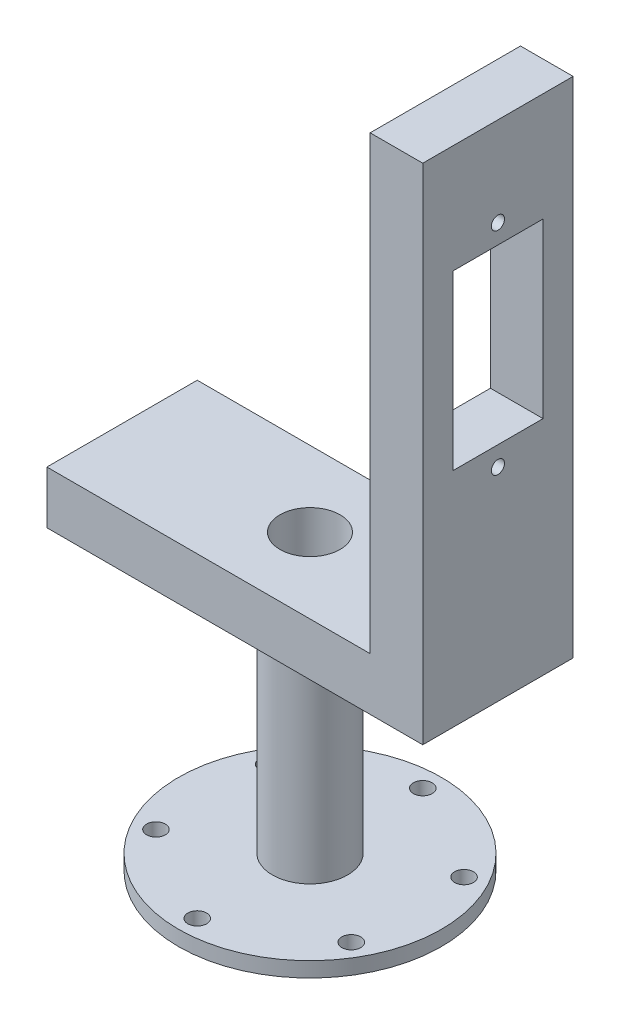
ISO-10303-21;
HEADER;
FILE_DESCRIPTION(('STEP AP214'),'2;1');
FILE_NAME('part.step','',(''),(''),'','','');
FILE_SCHEMA(('AUTOMOTIVE_DESIGN { 1 0 10303 214 1 1 1 1 }'));
ENDSEC;
DATA;
#1=APPLICATION_CONTEXT('core data for automotive mechanical design processes');
#2=APPLICATION_PROTOCOL_DEFINITION('international standard','automotive_design',2000,#1);
#3=PRODUCT_CONTEXT('',#1,'mechanical');
#4=PRODUCT('Part','Part','',(#3));
#5=PRODUCT_RELATED_PRODUCT_CATEGORY('part','',(#4));
#6=PRODUCT_DEFINITION_FORMATION('','',#4);
#7=PRODUCT_DEFINITION_CONTEXT('part definition',#1,'design');
#8=PRODUCT_DEFINITION('design','',#6,#7);
#9=PRODUCT_DEFINITION_SHAPE('','',#8);
#10=(LENGTH_UNIT() NAMED_UNIT(*) SI_UNIT(.MILLI.,.METRE.));
#11=(NAMED_UNIT(*) PLANE_ANGLE_UNIT() SI_UNIT($,.RADIAN.));
#12=(NAMED_UNIT(*) SI_UNIT($,.STERADIAN.) SOLID_ANGLE_UNIT());
#13=UNCERTAINTY_MEASURE_WITH_UNIT(LENGTH_MEASURE(1.E-05),#10,'distance_accuracy_value','');
#14=(GEOMETRIC_REPRESENTATION_CONTEXT(3) GLOBAL_UNCERTAINTY_ASSIGNED_CONTEXT((#13)) GLOBAL_UNIT_ASSIGNED_CONTEXT((#10,
#11,#12)) REPRESENTATION_CONTEXT('',''));
#15=CARTESIAN_POINT('',(0.,0.,0.));
#16=DIRECTION('',(0.,0.,1.));
#17=DIRECTION('',(1.,0.,0.));
#18=AXIS2_PLACEMENT_3D('',#15,#16,#17);
#19=CARTESIAN_POINT('',(0.,2.,0.));
#20=DIRECTION('',(0.,-1.,0.));
#21=DIRECTION('',(0.,0.,-1.));
#22=AXIS2_PLACEMENT_3D('',#19,#20,#21);
#23=CYLINDRICAL_SURFACE('',#22,17.5);
#24=CARTESIAN_POINT('',(0.,2.,0.));
#25=DIRECTION('',(0.,1.,0.));
#26=DIRECTION('',(0.,0.,1.));
#27=AXIS2_PLACEMENT_3D('',#24,#25,#26);
#28=CIRCLE('',#27,17.5);
#29=CARTESIAN_POINT('',(0.,2.,17.5));
#30=VERTEX_POINT('',#29);
#31=EDGE_CURVE('E11',#30,#30,#28,.T.);
#32=ORIENTED_EDGE('',*,*,#31,.F.);
#33=EDGE_LOOP('',(#32));
#34=FACE_BOUND('',#33,.T.);
#35=CARTESIAN_POINT('',(0.,0.,0.));
#36=DIRECTION('',(0.,1.,0.));
#37=DIRECTION('',(0.,0.,1.));
#38=AXIS2_PLACEMENT_3D('',#35,#36,#37);
#39=CIRCLE('',#38,17.5);
#40=CARTESIAN_POINT('',(0.,0.,17.5));
#41=VERTEX_POINT('',#40);
#42=EDGE_CURVE('E42',#41,#41,#39,.T.);
#43=ORIENTED_EDGE('',*,*,#42,.T.);
#44=EDGE_LOOP('',(#43));
#45=FACE_BOUND('',#44,.T.);
#46=ADVANCED_FACE('F34',(#34,#45),#23,.T.);
#47=CARTESIAN_POINT('',(0.,2.,0.));
#48=DIRECTION('',(0.,1.,0.));
#49=DIRECTION('',(0.,0.,1.));
#50=AXIS2_PLACEMENT_3D('',#47,#48,#49);
#51=PLANE('',#50);
#52=CARTESIAN_POINT('',(0.,2.,0.));
#53=DIRECTION('',(0.,1.,0.));
#54=DIRECTION('',(0.,0.,1.));
#55=AXIS2_PLACEMENT_3D('',#52,#53,#54);
#56=CIRCLE('',#55,5.);
#57=CARTESIAN_POINT('',(0.,2.,5.));
#58=VERTEX_POINT('',#57);
#59=EDGE_CURVE('E211',#58,#58,#56,.T.);
#60=ORIENTED_EDGE('',*,*,#59,.F.);
#61=EDGE_LOOP('',(#60));
#62=FACE_BOUND('',#61,.T.);
#63=CARTESIAN_POINT('',(12.9903810567665,2.,-7.50000000000015));
#64=DIRECTION('',(0.,1.,0.));
#65=DIRECTION('',(-0.866025403784433,0.,0.50000000000001));
#66=AXIS2_PLACEMENT_3D('',#63,#64,#65);
#67=CIRCLE('',#66,1.25);
#68=CARTESIAN_POINT('',(11.907849302036,2.,-6.87500000000014));
#69=VERTEX_POINT('',#68);
#70=EDGE_CURVE('E215',#69,#69,#67,.T.);
#71=ORIENTED_EDGE('',*,*,#70,.F.);
#72=EDGE_LOOP('',(#71));
#73=FACE_BOUND('',#72,.T.);
#74=CARTESIAN_POINT('',(12.9903810567666,2.,7.49999999999988));
#75=DIRECTION('',(0.,1.,0.));
#76=DIRECTION('',(-0.866025403784443,0.,-0.499999999999992));
#77=AXIS2_PLACEMENT_3D('',#74,#75,#76);
#78=CIRCLE('',#77,1.25);
#79=CARTESIAN_POINT('',(11.9078493020361,2.,6.87499999999989));
#80=VERTEX_POINT('',#79);
#81=EDGE_CURVE('E225',#80,#80,#78,.T.);
#82=ORIENTED_EDGE('',*,*,#81,.F.);
#83=EDGE_LOOP('',(#82));
#84=FACE_BOUND('',#83,.T.);
#85=CARTESIAN_POINT('',(0.,2.,15.));
#86=DIRECTION('',(0.,1.,0.));
#87=DIRECTION('',(0.,0.,-1.));
#88=AXIS2_PLACEMENT_3D('',#85,#86,#87);
#89=CIRCLE('',#88,1.25);
#90=CARTESIAN_POINT('',(0.,2.,13.75));
#91=VERTEX_POINT('',#90);
#92=EDGE_CURVE('E222',#91,#91,#89,.T.);
#93=ORIENTED_EDGE('',*,*,#92,.F.);
#94=EDGE_LOOP('',(#93));
#95=FACE_BOUND('',#94,.T.);
#96=CARTESIAN_POINT('',(-12.9903810567665,2.,7.50000000000006));
#97=DIRECTION('',(0.,1.,0.));
#98=DIRECTION('',(0.866025403784436,0.,-0.500000000000004));
#99=AXIS2_PLACEMENT_3D('',#96,#97,#98);
#100=CIRCLE('',#99,1.25);
#101=CARTESIAN_POINT('',(-11.907849302036,2.,6.87500000000006));
#102=VERTEX_POINT('',#101);
#103=EDGE_CURVE('E218',#102,#102,#100,.T.);
#104=ORIENTED_EDGE('',*,*,#103,.F.);
#105=EDGE_LOOP('',(#104));
#106=FACE_BOUND('',#105,.T.);
#107=CARTESIAN_POINT('',(-12.9903810567666,2.,-7.49999999999997));
#108=DIRECTION('',(0.,1.,0.));
#109=DIRECTION('',(0.86602540378444,0.,0.499999999999998));
#110=AXIS2_PLACEMENT_3D('',#107,#108,#109);
#111=CIRCLE('',#110,1.25);
#112=CARTESIAN_POINT('',(-11.907849302036,2.,-6.87499999999997));
#113=VERTEX_POINT('',#112);
#114=EDGE_CURVE('E221',#113,#113,#111,.T.);
#115=ORIENTED_EDGE('',*,*,#114,.F.);
#116=EDGE_LOOP('',(#115));
#117=FACE_BOUND('',#116,.T.);
#118=CARTESIAN_POINT('',(0.,2.,-15.));
#119=DIRECTION('',(0.,1.,0.));
#120=DIRECTION('',(0.,0.,1.));
#121=AXIS2_PLACEMENT_3D('',#118,#119,#120);
#122=CIRCLE('',#121,1.25);
#123=CARTESIAN_POINT('',(0.,2.,-13.75));
#124=VERTEX_POINT('',#123);
#125=EDGE_CURVE('E233',#124,#124,#122,.T.);
#126=ORIENTED_EDGE('',*,*,#125,.F.);
#127=EDGE_LOOP('',(#126));
#128=FACE_BOUND('',#127,.T.);
#129=ORIENTED_EDGE('',*,*,#31,.T.);
#130=EDGE_LOOP('',(#129));
#131=FACE_BOUND('',#130,.T.);
#132=ADVANCED_FACE('F275',(#62,#73,#84,#95,#106,#117,#128,#131),#51,.T.);
#133=CARTESIAN_POINT('',(0.,0.,0.));
#134=DIRECTION('',(0.,1.,0.));
#135=DIRECTION('',(0.,0.,1.));
#136=AXIS2_PLACEMENT_3D('',#133,#134,#135);
#137=PLANE('',#136);
#138=CARTESIAN_POINT('',(0.,0.,0.));
#139=DIRECTION('',(0.,-1.,0.));
#140=DIRECTION('',(0.,0.,-1.));
#141=AXIS2_PLACEMENT_3D('',#138,#139,#140);
#142=CIRCLE('',#141,4.);
#143=CARTESIAN_POINT('',(0.,0.,-4.));
#144=VERTEX_POINT('',#143);
#145=EDGE_CURVE('E136',#144,#144,#142,.T.);
#146=ORIENTED_EDGE('',*,*,#145,.F.);
#147=EDGE_LOOP('',(#146));
#148=FACE_BOUND('',#147,.T.);
#149=CARTESIAN_POINT('',(12.9903810567665,0.,-7.50000000000015));
#150=DIRECTION('',(0.,1.,0.));
#151=DIRECTION('',(0.,0.,1.));
#152=AXIS2_PLACEMENT_3D('',#149,#150,#151);
#153=CIRCLE('',#152,1.25);
#154=CARTESIAN_POINT('',(12.9903810567665,0.,-6.25000000000015));
#155=VERTEX_POINT('',#154);
#156=EDGE_CURVE('E37',#155,#155,#153,.T.);
#157=ORIENTED_EDGE('',*,*,#156,.T.);
#158=EDGE_LOOP('',(#157));
#159=FACE_BOUND('',#158,.T.);
#160=CARTESIAN_POINT('',(12.9903810567666,0.,7.49999999999988));
#161=DIRECTION('',(0.,1.,0.));
#162=DIRECTION('',(0.,0.,1.));
#163=AXIS2_PLACEMENT_3D('',#160,#161,#162);
#164=CIRCLE('',#163,1.25);
#165=CARTESIAN_POINT('',(12.9903810567666,0.,8.74999999999988));
#166=VERTEX_POINT('',#165);
#167=EDGE_CURVE('E248',#166,#166,#164,.T.);
#168=ORIENTED_EDGE('',*,*,#167,.T.);
#169=EDGE_LOOP('',(#168));
#170=FACE_BOUND('',#169,.T.);
#171=CARTESIAN_POINT('',(0.,0.,15.));
#172=DIRECTION('',(0.,1.,0.));
#173=DIRECTION('',(0.,0.,1.));
#174=AXIS2_PLACEMENT_3D('',#171,#172,#173);
#175=CIRCLE('',#174,1.25);
#176=CARTESIAN_POINT('',(0.,0.,16.25));
#177=VERTEX_POINT('',#176);
#178=EDGE_CURVE('E246',#177,#177,#175,.T.);
#179=ORIENTED_EDGE('',*,*,#178,.T.);
#180=EDGE_LOOP('',(#179));
#181=FACE_BOUND('',#180,.T.);
#182=CARTESIAN_POINT('',(-12.9903810567665,0.,7.50000000000006));
#183=DIRECTION('',(0.,1.,0.));
#184=DIRECTION('',(0.,0.,1.));
#185=AXIS2_PLACEMENT_3D('',#182,#183,#184);
#186=CIRCLE('',#185,1.25);
#187=CARTESIAN_POINT('',(-12.9903810567665,0.,8.75000000000006));
#188=VERTEX_POINT('',#187);
#189=EDGE_CURVE('E243',#188,#188,#186,.T.);
#190=ORIENTED_EDGE('',*,*,#189,.T.);
#191=EDGE_LOOP('',(#190));
#192=FACE_BOUND('',#191,.T.);
#193=CARTESIAN_POINT('',(-12.9903810567666,0.,-7.49999999999997));
#194=DIRECTION('',(0.,1.,0.));
#195=DIRECTION('',(0.,0.,1.));
#196=AXIS2_PLACEMENT_3D('',#193,#194,#195);
#197=CIRCLE('',#196,1.25);
#198=CARTESIAN_POINT('',(-12.9903810567666,0.,-6.24999999999997));
#199=VERTEX_POINT('',#198);
#200=EDGE_CURVE('E232',#199,#199,#197,.T.);
#201=ORIENTED_EDGE('',*,*,#200,.T.);
#202=EDGE_LOOP('',(#201));
#203=FACE_BOUND('',#202,.T.);
#204=CARTESIAN_POINT('',(0.,0.,-15.));
#205=DIRECTION('',(0.,1.,0.));
#206=DIRECTION('',(0.,0.,1.));
#207=AXIS2_PLACEMENT_3D('',#204,#205,#206);
#208=CIRCLE('',#207,1.25);
#209=CARTESIAN_POINT('',(0.,0.,-13.75));
#210=VERTEX_POINT('',#209);
#211=EDGE_CURVE('E235',#210,#210,#208,.T.);
#212=ORIENTED_EDGE('',*,*,#211,.T.);
#213=EDGE_LOOP('',(#212));
#214=FACE_BOUND('',#213,.T.);
#215=ORIENTED_EDGE('',*,*,#42,.F.);
#216=EDGE_LOOP('',(#215));
#217=FACE_BOUND('',#216,.T.);
#218=ADVANCED_FACE('F255',(#148,#159,#170,#181,#192,#203,#214,#217),#137,.F.);
#219=CARTESIAN_POINT('',(0.,-3.,-15.));
#220=DIRECTION('',(0.,1.,0.));
#221=DIRECTION('',(0.,0.,1.));
#222=AXIS2_PLACEMENT_3D('',#219,#220,#221);
#223=CYLINDRICAL_SURFACE('',#222,1.25);
#224=ORIENTED_EDGE('',*,*,#125,.T.);
#225=EDGE_LOOP('',(#224));
#226=FACE_BOUND('',#225,.T.);
#227=ORIENTED_EDGE('',*,*,#211,.F.);
#228=EDGE_LOOP('',(#227));
#229=FACE_BOUND('',#228,.T.);
#230=ADVANCED_FACE('F287',(#226,#229),#223,.F.);
#231=CARTESIAN_POINT('',(-12.9903810567666,-3.,-7.49999999999997));
#232=DIRECTION('',(0.,1.,0.));
#233=DIRECTION('',(0.,0.,1.));
#234=AXIS2_PLACEMENT_3D('',#231,#232,#233);
#235=CYLINDRICAL_SURFACE('',#234,1.25);
#236=ORIENTED_EDGE('',*,*,#114,.T.);
#237=EDGE_LOOP('',(#236));
#238=FACE_BOUND('',#237,.T.);
#239=ORIENTED_EDGE('',*,*,#200,.F.);
#240=EDGE_LOOP('',(#239));
#241=FACE_BOUND('',#240,.T.);
#242=ADVANCED_FACE('F294',(#238,#241),#235,.F.);
#243=CARTESIAN_POINT('',(-12.9903810567665,-3.,7.50000000000006));
#244=DIRECTION('',(0.,1.,0.));
#245=DIRECTION('',(0.,0.,1.));
#246=AXIS2_PLACEMENT_3D('',#243,#244,#245);
#247=CYLINDRICAL_SURFACE('',#246,1.25);
#248=ORIENTED_EDGE('',*,*,#103,.T.);
#249=EDGE_LOOP('',(#248));
#250=FACE_BOUND('',#249,.T.);
#251=ORIENTED_EDGE('',*,*,#189,.F.);
#252=EDGE_LOOP('',(#251));
#253=FACE_BOUND('',#252,.T.);
#254=ADVANCED_FACE('F299',(#250,#253),#247,.F.);
#255=CARTESIAN_POINT('',(0.,-3.,15.));
#256=DIRECTION('',(0.,1.,0.));
#257=DIRECTION('',(0.,0.,1.));
#258=AXIS2_PLACEMENT_3D('',#255,#256,#257);
#259=CYLINDRICAL_SURFACE('',#258,1.25);
#260=ORIENTED_EDGE('',*,*,#92,.T.);
#261=EDGE_LOOP('',(#260));
#262=FACE_BOUND('',#261,.T.);
#263=ORIENTED_EDGE('',*,*,#178,.F.);
#264=EDGE_LOOP('',(#263));
#265=FACE_BOUND('',#264,.T.);
#266=ADVANCED_FACE('F270',(#262,#265),#259,.F.);
#267=CARTESIAN_POINT('',(12.9903810567666,-3.,7.49999999999988));
#268=DIRECTION('',(0.,1.,0.));
#269=DIRECTION('',(0.,0.,1.));
#270=AXIS2_PLACEMENT_3D('',#267,#268,#269);
#271=CYLINDRICAL_SURFACE('',#270,1.25);
#272=ORIENTED_EDGE('',*,*,#81,.T.);
#273=EDGE_LOOP('',(#272));
#274=FACE_BOUND('',#273,.T.);
#275=ORIENTED_EDGE('',*,*,#167,.F.);
#276=EDGE_LOOP('',(#275));
#277=FACE_BOUND('',#276,.T.);
#278=ADVANCED_FACE('F260',(#274,#277),#271,.F.);
#279=CARTESIAN_POINT('',(12.9903810567665,-3.,-7.50000000000015));
#280=DIRECTION('',(0.,1.,0.));
#281=DIRECTION('',(0.,0.,1.));
#282=AXIS2_PLACEMENT_3D('',#279,#280,#281);
#283=CYLINDRICAL_SURFACE('',#282,1.25);
#284=ORIENTED_EDGE('',*,*,#70,.T.);
#285=EDGE_LOOP('',(#284));
#286=FACE_BOUND('',#285,.T.);
#287=ORIENTED_EDGE('',*,*,#156,.F.);
#288=EDGE_LOOP('',(#287));
#289=FACE_BOUND('',#288,.T.);
#290=ADVANCED_FACE('F257',(#286,#289),#283,.F.);
#291=CARTESIAN_POINT('',(0.,32.,0.));
#292=DIRECTION('',(0.,-1.,0.));
#293=DIRECTION('',(0.,0.,-1.));
#294=AXIS2_PLACEMENT_3D('',#291,#292,#293);
#295=CYLINDRICAL_SURFACE('',#294,5.);
#296=CARTESIAN_POINT('',(0.,32.,0.));
#297=DIRECTION('',(0.,1.,0.));
#298=DIRECTION('',(0.,0.,1.));
#299=AXIS2_PLACEMENT_3D('',#296,#297,#298);
#300=CIRCLE('',#299,5.);
#301=CARTESIAN_POINT('',(0.,32.,5.));
#302=VERTEX_POINT('',#301);
#303=EDGE_CURVE('E212',#302,#302,#300,.T.);
#304=ORIENTED_EDGE('',*,*,#303,.F.);
#305=EDGE_LOOP('',(#304));
#306=FACE_BOUND('',#305,.T.);
#307=ORIENTED_EDGE('',*,*,#59,.T.);
#308=EDGE_LOOP('',(#307));
#309=FACE_BOUND('',#308,.T.);
#310=ADVANCED_FACE('F259',(#306,#309),#295,.T.);
#311=CARTESIAN_POINT('',(-25.,39.,-10.));
#312=DIRECTION('',(1.,0.,0.));
#313=DIRECTION('',(0.,0.,-1.));
#314=AXIS2_PLACEMENT_3D('',#311,#312,#313);
#315=PLANE('',#314);
#316=DIRECTION('',(0.,0.,1.));
#317=VECTOR('',#316,1.);
#318=CARTESIAN_POINT('',(-25.,32.,-10.));
#319=LINE('',#318,#317);
#320=CARTESIAN_POINT('',(-25.,32.,-10.));
#321=VERTEX_POINT('',#320);
#322=CARTESIAN_POINT('',(-25.,32.,10.));
#323=VERTEX_POINT('',#322);
#324=EDGE_CURVE('E183',#321,#323,#319,.T.);
#325=ORIENTED_EDGE('',*,*,#324,.T.);
#326=DIRECTION('',(0.,-1.,0.));
#327=VECTOR('',#326,1.);
#328=CARTESIAN_POINT('',(-25.,39.,10.));
#329=LINE('',#328,#327);
#330=CARTESIAN_POINT('',(-25.,39.,10.));
#331=VERTEX_POINT('',#330);
#332=EDGE_CURVE('E208',#331,#323,#329,.T.);
#333=ORIENTED_EDGE('',*,*,#332,.F.);
#334=DIRECTION('',(0.,0.,1.));
#335=VECTOR('',#334,1.);
#336=CARTESIAN_POINT('',(-25.,39.,-10.));
#337=LINE('',#336,#335);
#338=CARTESIAN_POINT('',(-25.,39.,-10.));
#339=VERTEX_POINT('',#338);
#340=EDGE_CURVE('E184',#339,#331,#337,.T.);
#341=ORIENTED_EDGE('',*,*,#340,.F.);
#342=DIRECTION('',(0.,-1.,0.));
#343=VECTOR('',#342,1.);
#344=CARTESIAN_POINT('',(-25.,39.,-10.));
#345=LINE('',#344,#343);
#346=EDGE_CURVE('E192',#339,#321,#345,.T.);
#347=ORIENTED_EDGE('',*,*,#346,.T.);
#348=EDGE_LOOP('',(#325,#333,#341,#347));
#349=FACE_BOUND('',#348,.T.);
#350=ADVANCED_FACE('F267',(#349),#315,.F.);
#351=CARTESIAN_POINT('',(-25.,39.,10.));
#352=DIRECTION('',(0.,0.,-1.));
#353=DIRECTION('',(-1.,0.,0.));
#354=AXIS2_PLACEMENT_3D('',#351,#352,#353);
#355=PLANE('',#354);
#356=DIRECTION('',(1.,0.,0.));
#357=VECTOR('',#356,1.);
#358=CARTESIAN_POINT('',(-25.,32.,10.));
#359=LINE('',#358,#357);
#360=CARTESIAN_POINT('',(25.,32.,10.));
#361=VERTEX_POINT('',#360);
#362=EDGE_CURVE('E195',#323,#361,#359,.T.);
#363=ORIENTED_EDGE('',*,*,#362,.T.);
#364=DIRECTION('',(0.,-1.,0.));
#365=VECTOR('',#364,1.);
#366=CARTESIAN_POINT('',(25.,39.,10.));
#367=LINE('',#366,#365);
#368=CARTESIAN_POINT('',(25.,99.,10.));
#369=VERTEX_POINT('',#368);
#370=EDGE_CURVE('E205',#369,#361,#367,.T.);
#371=ORIENTED_EDGE('',*,*,#370,.F.);
#372=DIRECTION('',(1.,0.,0.));
#373=VECTOR('',#372,1.);
#374=CARTESIAN_POINT('',(18.,99.,10.));
#375=LINE('',#374,#373);
#376=CARTESIAN_POINT('',(18.,99.,10.));
#377=VERTEX_POINT('',#376);
#378=EDGE_CURVE('E167',#377,#369,#375,.T.);
#379=ORIENTED_EDGE('',*,*,#378,.F.);
#380=DIRECTION('',(0.,-1.,0.));
#381=VECTOR('',#380,1.);
#382=CARTESIAN_POINT('',(18.,99.,10.));
#383=LINE('',#382,#381);
#384=CARTESIAN_POINT('',(18.,39.,10.));
#385=VERTEX_POINT('',#384);
#386=EDGE_CURVE('E180',#377,#385,#383,.T.);
#387=ORIENTED_EDGE('',*,*,#386,.T.);
#388=DIRECTION('',(1.,0.,0.));
#389=VECTOR('',#388,1.);
#390=CARTESIAN_POINT('',(-25.,39.,10.));
#391=LINE('',#390,#389);
#392=EDGE_CURVE('E187',#331,#385,#391,.T.);
#393=ORIENTED_EDGE('',*,*,#392,.F.);
#394=ORIENTED_EDGE('',*,*,#332,.T.);
#395=EDGE_LOOP('',(#363,#371,#379,#387,#393,#394));
#396=FACE_BOUND('',#395,.T.);
#397=ADVANCED_FACE('F326',(#396),#355,.F.);
#398=CARTESIAN_POINT('',(25.,39.,-10.));
#399=DIRECTION('',(-1.,0.,0.));
#400=DIRECTION('',(0.,0.,1.));
#401=AXIS2_PLACEMENT_3D('',#398,#399,#400);
#402=PLANE('',#401);
#403=DIRECTION('',(0.,0.,-1.));
#404=VECTOR('',#403,1.);
#405=CARTESIAN_POINT('',(25.,84.575,-6.));
#406=LINE('',#405,#404);
#407=CARTESIAN_POINT('',(25.,84.575,6.));
#408=VERTEX_POINT('',#407);
#409=CARTESIAN_POINT('',(25.,84.575,-6.));
#410=VERTEX_POINT('',#409);
#411=EDGE_CURVE('E120',#408,#410,#406,.T.);
#412=ORIENTED_EDGE('',*,*,#411,.T.);
#413=DIRECTION('',(0.,-1.,0.));
#414=VECTOR('',#413,1.);
#415=CARTESIAN_POINT('',(25.,84.575,-6.));
#416=LINE('',#415,#414);
#417=CARTESIAN_POINT('',(25.,61.575,-6.));
#418=VERTEX_POINT('',#417);
#419=EDGE_CURVE('E114',#410,#418,#416,.T.);
#420=ORIENTED_EDGE('',*,*,#419,.T.);
#421=DIRECTION('',(0.,0.,1.));
#422=VECTOR('',#421,1.);
#423=CARTESIAN_POINT('',(25.,61.575,-6.));
#424=LINE('',#423,#422);
#425=CARTESIAN_POINT('',(25.,61.575,6.));
#426=VERTEX_POINT('',#425);
#427=EDGE_CURVE('E123',#418,#426,#424,.T.);
#428=ORIENTED_EDGE('',*,*,#427,.T.);
#429=DIRECTION('',(0.,1.,0.));
#430=VECTOR('',#429,1.);
#431=CARTESIAN_POINT('',(25.,84.575,6.));
#432=LINE('',#431,#430);
#433=EDGE_CURVE('E50',#426,#408,#432,.T.);
#434=ORIENTED_EDGE('',*,*,#433,.T.);
#435=EDGE_LOOP('',(#412,#420,#428,#434));
#436=FACE_BOUND('',#435,.T.);
#437=CARTESIAN_POINT('',(25.,87.15,0.));
#438=DIRECTION('',(-1.,0.,0.));
#439=DIRECTION('',(0.,0.,1.));
#440=AXIS2_PLACEMENT_3D('',#437,#438,#439);
#441=CIRCLE('',#440,0.875);
#442=CARTESIAN_POINT('',(25.,87.15,0.874999999999996));
#443=VERTEX_POINT('',#442);
#444=EDGE_CURVE('E152',#443,#443,#441,.T.);
#445=ORIENTED_EDGE('',*,*,#444,.T.);
#446=EDGE_LOOP('',(#445));
#447=FACE_BOUND('',#446,.T.);
#448=CARTESIAN_POINT('',(25.,59.,2.90518790375361E-13));
#449=DIRECTION('',(-1.,0.,0.));
#450=DIRECTION('',(0.,0.,1.));
#451=AXIS2_PLACEMENT_3D('',#448,#449,#450);
#452=CIRCLE('',#451,0.875);
#453=CARTESIAN_POINT('',(25.,59.,0.875000000000291));
#454=VERTEX_POINT('',#453);
#455=EDGE_CURVE('E159',#454,#454,#452,.T.);
#456=ORIENTED_EDGE('',*,*,#455,.T.);
#457=EDGE_LOOP('',(#456));
#458=FACE_BOUND('',#457,.T.);
#459=DIRECTION('',(0.,0.,-1.));
#460=VECTOR('',#459,1.);
#461=CARTESIAN_POINT('',(25.,32.,-10.));
#462=LINE('',#461,#460);
#463=CARTESIAN_POINT('',(25.,32.,-10.));
#464=VERTEX_POINT('',#463);
#465=EDGE_CURVE('E197',#361,#464,#462,.T.);
#466=ORIENTED_EDGE('',*,*,#465,.T.);
#467=DIRECTION('',(0.,-1.,0.));
#468=VECTOR('',#467,1.);
#469=CARTESIAN_POINT('',(25.,39.,-10.));
#470=LINE('',#469,#468);
#471=CARTESIAN_POINT('',(25.,99.,-10.));
#472=VERTEX_POINT('',#471);
#473=EDGE_CURVE('E202',#472,#464,#470,.T.);
#474=ORIENTED_EDGE('',*,*,#473,.F.);
#475=DIRECTION('',(0.,0.,-1.));
#476=VECTOR('',#475,1.);
#477=CARTESIAN_POINT('',(25.,99.,-10.));
#478=LINE('',#477,#476);
#479=EDGE_CURVE('E170',#369,#472,#478,.T.);
#480=ORIENTED_EDGE('',*,*,#479,.F.);
#481=ORIENTED_EDGE('',*,*,#370,.T.);
#482=EDGE_LOOP('',(#466,#474,#480,#481));
#483=FACE_BOUND('',#482,.T.);
#484=ADVANCED_FACE('F127',(#436,#447,#458,#483),#402,.F.);
#485=CARTESIAN_POINT('',(-25.,39.,-10.));
#486=DIRECTION('',(0.,0.,1.));
#487=DIRECTION('',(1.,0.,0.));
#488=AXIS2_PLACEMENT_3D('',#485,#486,#487);
#489=PLANE('',#488);
#490=DIRECTION('',(-1.,0.,0.));
#491=VECTOR('',#490,1.);
#492=CARTESIAN_POINT('',(-25.,32.,-10.));
#493=LINE('',#492,#491);
#494=EDGE_CURVE('E188',#464,#321,#493,.T.);
#495=ORIENTED_EDGE('',*,*,#494,.T.);
#496=ORIENTED_EDGE('',*,*,#346,.F.);
#497=DIRECTION('',(-1.,0.,0.));
#498=VECTOR('',#497,1.);
#499=CARTESIAN_POINT('',(-25.,39.,-10.));
#500=LINE('',#499,#498);
#501=CARTESIAN_POINT('',(18.,39.,-10.));
#502=VERTEX_POINT('',#501);
#503=EDGE_CURVE('E190',#502,#339,#500,.T.);
#504=ORIENTED_EDGE('',*,*,#503,.F.);
#505=DIRECTION('',(0.,-1.,0.));
#506=VECTOR('',#505,1.);
#507=CARTESIAN_POINT('',(18.,99.,-10.));
#508=LINE('',#507,#506);
#509=CARTESIAN_POINT('',(18.,99.,-10.));
#510=VERTEX_POINT('',#509);
#511=EDGE_CURVE('E175',#510,#502,#508,.T.);
#512=ORIENTED_EDGE('',*,*,#511,.F.);
#513=DIRECTION('',(-1.,0.,0.));
#514=VECTOR('',#513,1.);
#515=CARTESIAN_POINT('',(18.,99.,-10.));
#516=LINE('',#515,#514);
#517=EDGE_CURVE('E173',#472,#510,#516,.T.);
#518=ORIENTED_EDGE('',*,*,#517,.F.);
#519=ORIENTED_EDGE('',*,*,#473,.T.);
#520=EDGE_LOOP('',(#495,#496,#504,#512,#518,#519));
#521=FACE_BOUND('',#520,.T.);
#522=ADVANCED_FACE('F333',(#521),#489,.F.);
#523=CARTESIAN_POINT('',(0.,39.,0.));
#524=DIRECTION('',(0.,1.,0.));
#525=DIRECTION('',(0.,0.,1.));
#526=AXIS2_PLACEMENT_3D('',#523,#524,#525);
#527=PLANE('',#526);
#528=CARTESIAN_POINT('',(0.,39.,0.));
#529=DIRECTION('',(0.,-1.,0.));
#530=DIRECTION('',(0.,0.,-1.));
#531=AXIS2_PLACEMENT_3D('',#528,#529,#530);
#532=CIRCLE('',#531,4.);
#533=CARTESIAN_POINT('',(0.,39.,-4.));
#534=VERTEX_POINT('',#533);
#535=EDGE_CURVE('E380',#534,#534,#532,.T.);
#536=ORIENTED_EDGE('',*,*,#535,.T.);
#537=EDGE_LOOP('',(#536));
#538=FACE_BOUND('',#537,.T.);
#539=DIRECTION('',(0.,0.,1.));
#540=VECTOR('',#539,1.);
#541=CARTESIAN_POINT('',(18.,39.,-10.));
#542=LINE('',#541,#540);
#543=EDGE_CURVE('E155',#502,#385,#542,.T.);
#544=ORIENTED_EDGE('',*,*,#543,.F.);
#545=ORIENTED_EDGE('',*,*,#503,.T.);
#546=ORIENTED_EDGE('',*,*,#340,.T.);
#547=ORIENTED_EDGE('',*,*,#392,.T.);
#548=EDGE_LOOP('',(#544,#545,#546,#547));
#549=FACE_BOUND('',#548,.T.);
#550=ADVANCED_FACE('F336',(#538,#549),#527,.T.);
#551=CARTESIAN_POINT('',(0.,32.,0.));
#552=DIRECTION('',(0.,1.,0.));
#553=DIRECTION('',(0.,0.,1.));
#554=AXIS2_PLACEMENT_3D('',#551,#552,#553);
#555=PLANE('',#554);
#556=ORIENTED_EDGE('',*,*,#303,.T.);
#557=EDGE_LOOP('',(#556));
#558=FACE_BOUND('',#557,.T.);
#559=ORIENTED_EDGE('',*,*,#324,.F.);
#560=ORIENTED_EDGE('',*,*,#494,.F.);
#561=ORIENTED_EDGE('',*,*,#465,.F.);
#562=ORIENTED_EDGE('',*,*,#362,.F.);
#563=EDGE_LOOP('',(#559,#560,#561,#562));
#564=FACE_BOUND('',#563,.T.);
#565=ADVANCED_FACE('F338',(#558,#564),#555,.F.);
#566=CARTESIAN_POINT('',(18.,99.,-10.));
#567=DIRECTION('',(1.,0.,0.));
#568=DIRECTION('',(0.,0.,-1.));
#569=AXIS2_PLACEMENT_3D('',#566,#567,#568);
#570=PLANE('',#569);
#571=DIRECTION('',(0.,0.,1.));
#572=VECTOR('',#571,1.);
#573=CARTESIAN_POINT('',(18.,61.575,-6.));
#574=LINE('',#573,#572);
#575=CARTESIAN_POINT('',(18.,61.575,-6.));
#576=VERTEX_POINT('',#575);
#577=CARTESIAN_POINT('',(18.,61.575,6.));
#578=VERTEX_POINT('',#577);
#579=EDGE_CURVE('E142',#576,#578,#574,.T.);
#580=ORIENTED_EDGE('',*,*,#579,.F.);
#581=DIRECTION('',(0.,-1.,0.));
#582=VECTOR('',#581,1.);
#583=CARTESIAN_POINT('',(18.,84.575,-6.));
#584=LINE('',#583,#582);
#585=CARTESIAN_POINT('',(18.,84.575,-6.));
#586=VERTEX_POINT('',#585);
#587=EDGE_CURVE('E58',#586,#576,#584,.T.);
#588=ORIENTED_EDGE('',*,*,#587,.F.);
#589=DIRECTION('',(0.,0.,-1.));
#590=VECTOR('',#589,1.);
#591=CARTESIAN_POINT('',(18.,84.575,-6.));
#592=LINE('',#591,#590);
#593=CARTESIAN_POINT('',(18.,84.575,6.));
#594=VERTEX_POINT('',#593);
#595=EDGE_CURVE('E130',#594,#586,#592,.T.);
#596=ORIENTED_EDGE('',*,*,#595,.F.);
#597=DIRECTION('',(0.,1.,0.));
#598=VECTOR('',#597,1.);
#599=CARTESIAN_POINT('',(18.,84.575,6.));
#600=LINE('',#599,#598);
#601=EDGE_CURVE('E133',#578,#594,#600,.T.);
#602=ORIENTED_EDGE('',*,*,#601,.F.);
#603=EDGE_LOOP('',(#580,#588,#596,#602));
#604=FACE_BOUND('',#603,.T.);
#605=CARTESIAN_POINT('',(18.,87.15,0.));
#606=DIRECTION('',(-1.,0.,0.));
#607=DIRECTION('',(0.,0.,1.));
#608=AXIS2_PLACEMENT_3D('',#605,#606,#607);
#609=CIRCLE('',#608,0.875);
#610=CARTESIAN_POINT('',(18.,87.15,0.874999999999997));
#611=VERTEX_POINT('',#610);
#612=EDGE_CURVE('E156',#611,#611,#609,.T.);
#613=ORIENTED_EDGE('',*,*,#612,.F.);
#614=EDGE_LOOP('',(#613));
#615=FACE_BOUND('',#614,.T.);
#616=CARTESIAN_POINT('',(18.,59.,2.91733096808544E-13));
#617=DIRECTION('',(-1.,0.,0.));
#618=DIRECTION('',(0.,0.,1.));
#619=AXIS2_PLACEMENT_3D('',#616,#617,#618);
#620=CIRCLE('',#619,0.875);
#621=CARTESIAN_POINT('',(18.,59.,0.875000000000292));
#622=VERTEX_POINT('',#621);
#623=EDGE_CURVE('E148',#622,#622,#620,.T.);
#624=ORIENTED_EDGE('',*,*,#623,.F.);
#625=EDGE_LOOP('',(#624));
#626=FACE_BOUND('',#625,.T.);
#627=ORIENTED_EDGE('',*,*,#543,.T.);
#628=ORIENTED_EDGE('',*,*,#386,.F.);
#629=DIRECTION('',(0.,0.,1.));
#630=VECTOR('',#629,1.);
#631=CARTESIAN_POINT('',(18.,99.,-10.));
#632=LINE('',#631,#630);
#633=EDGE_CURVE('E164',#510,#377,#632,.T.);
#634=ORIENTED_EDGE('',*,*,#633,.F.);
#635=ORIENTED_EDGE('',*,*,#511,.T.);
#636=EDGE_LOOP('',(#627,#628,#634,#635));
#637=FACE_BOUND('',#636,.T.);
#638=ADVANCED_FACE('F341',(#604,#615,#626,#637),#570,.F.);
#639=CARTESIAN_POINT('',(0.,99.,0.));
#640=DIRECTION('',(0.,1.,0.));
#641=DIRECTION('',(0.,0.,1.));
#642=AXIS2_PLACEMENT_3D('',#639,#640,#641);
#643=PLANE('',#642);
#644=ORIENTED_EDGE('',*,*,#633,.T.);
#645=ORIENTED_EDGE('',*,*,#378,.T.);
#646=ORIENTED_EDGE('',*,*,#479,.T.);
#647=ORIENTED_EDGE('',*,*,#517,.T.);
#648=EDGE_LOOP('',(#644,#645,#646,#647));
#649=FACE_BOUND('',#648,.T.);
#650=ADVANCED_FACE('F347',(#649),#643,.T.);
#651=CARTESIAN_POINT('',(25.,59.,2.90518790375361E-13));
#652=DIRECTION('',(-1.,0.,0.));
#653=DIRECTION('',(0.,0.,1.));
#654=AXIS2_PLACEMENT_3D('',#651,#652,#653);
#655=CYLINDRICAL_SURFACE('',#654,0.875);
#656=ORIENTED_EDGE('',*,*,#455,.F.);
#657=EDGE_LOOP('',(#656));
#658=FACE_BOUND('',#657,.T.);
#659=ORIENTED_EDGE('',*,*,#623,.T.);
#660=EDGE_LOOP('',(#659));
#661=FACE_BOUND('',#660,.T.);
#662=ADVANCED_FACE('F351',(#658,#661),#655,.F.);
#663=CARTESIAN_POINT('',(25.,87.15,0.));
#664=DIRECTION('',(-1.,0.,0.));
#665=DIRECTION('',(0.,0.,1.));
#666=AXIS2_PLACEMENT_3D('',#663,#664,#665);
#667=CYLINDRICAL_SURFACE('',#666,0.875);
#668=ORIENTED_EDGE('',*,*,#444,.F.);
#669=EDGE_LOOP('',(#668));
#670=FACE_BOUND('',#669,.T.);
#671=ORIENTED_EDGE('',*,*,#612,.T.);
#672=EDGE_LOOP('',(#671));
#673=FACE_BOUND('',#672,.T.);
#674=ADVANCED_FACE('F355',(#670,#673),#667,.F.);
#675=CARTESIAN_POINT('',(25.,84.575,-6.));
#676=DIRECTION('',(0.,0.,-1.));
#677=DIRECTION('',(-1.,0.,0.));
#678=AXIS2_PLACEMENT_3D('',#675,#676,#677);
#679=PLANE('',#678);
#680=ORIENTED_EDGE('',*,*,#587,.T.);
#681=DIRECTION('',(-1.,0.,0.));
#682=VECTOR('',#681,1.);
#683=CARTESIAN_POINT('',(25.,61.575,-6.));
#684=LINE('',#683,#682);
#685=EDGE_CURVE('E110',#418,#576,#684,.T.);
#686=ORIENTED_EDGE('',*,*,#685,.F.);
#687=ORIENTED_EDGE('',*,*,#419,.F.);
#688=DIRECTION('',(-1.,0.,0.));
#689=VECTOR('',#688,1.);
#690=CARTESIAN_POINT('',(25.,84.575,-6.));
#691=LINE('',#690,#689);
#692=EDGE_CURVE('E146',#410,#586,#691,.T.);
#693=ORIENTED_EDGE('',*,*,#692,.T.);
#694=EDGE_LOOP('',(#680,#686,#687,#693));
#695=FACE_BOUND('',#694,.T.);
#696=ADVANCED_FACE('F112',(#695),#679,.F.);
#697=CARTESIAN_POINT('',(25.,84.575,-6.));
#698=DIRECTION('',(0.,1.,0.));
#699=DIRECTION('',(0.,0.,1.));
#700=AXIS2_PLACEMENT_3D('',#697,#698,#699);
#701=PLANE('',#700);
#702=ORIENTED_EDGE('',*,*,#595,.T.);
#703=ORIENTED_EDGE('',*,*,#692,.F.);
#704=ORIENTED_EDGE('',*,*,#411,.F.);
#705=DIRECTION('',(-1.,0.,0.));
#706=VECTOR('',#705,1.);
#707=CARTESIAN_POINT('',(25.,84.575,6.));
#708=LINE('',#707,#706);
#709=EDGE_CURVE('E149',#408,#594,#708,.T.);
#710=ORIENTED_EDGE('',*,*,#709,.T.);
#711=EDGE_LOOP('',(#702,#703,#704,#710));
#712=FACE_BOUND('',#711,.T.);
#713=ADVANCED_FACE('F362',(#712),#701,.F.);
#714=CARTESIAN_POINT('',(25.,84.575,6.));
#715=DIRECTION('',(0.,0.,1.));
#716=DIRECTION('',(1.,0.,0.));
#717=AXIS2_PLACEMENT_3D('',#714,#715,#716);
#718=PLANE('',#717);
#719=ORIENTED_EDGE('',*,*,#601,.T.);
#720=ORIENTED_EDGE('',*,*,#709,.F.);
#721=ORIENTED_EDGE('',*,*,#433,.F.);
#722=DIRECTION('',(-1.,0.,0.));
#723=VECTOR('',#722,1.);
#724=CARTESIAN_POINT('',(25.,61.575,6.));
#725=LINE('',#724,#723);
#726=EDGE_CURVE('E119',#426,#578,#725,.T.);
#727=ORIENTED_EDGE('',*,*,#726,.T.);
#728=EDGE_LOOP('',(#719,#720,#721,#727));
#729=FACE_BOUND('',#728,.T.);
#730=ADVANCED_FACE('F366',(#729),#718,.F.);
#731=CARTESIAN_POINT('',(25.,61.575,-6.));
#732=DIRECTION('',(0.,-1.,0.));
#733=DIRECTION('',(0.,0.,-1.));
#734=AXIS2_PLACEMENT_3D('',#731,#732,#733);
#735=PLANE('',#734);
#736=ORIENTED_EDGE('',*,*,#579,.T.);
#737=ORIENTED_EDGE('',*,*,#726,.F.);
#738=ORIENTED_EDGE('',*,*,#427,.F.);
#739=ORIENTED_EDGE('',*,*,#685,.T.);
#740=EDGE_LOOP('',(#736,#737,#738,#739));
#741=FACE_BOUND('',#740,.T.);
#742=ADVANCED_FACE('F124',(#741),#735,.F.);
#743=CARTESIAN_POINT('',(0.,0.,0.));
#744=DIRECTION('',(0.,1.,0.));
#745=DIRECTION('',(0.,0.,1.));
#746=AXIS2_PLACEMENT_3D('',#743,#744,#745);
#747=CYLINDRICAL_SURFACE('',#746,4.);
#748=ORIENTED_EDGE('',*,*,#145,.T.);
#749=EDGE_LOOP('',(#748));
#750=FACE_BOUND('',#749,.T.);
#751=ORIENTED_EDGE('',*,*,#535,.F.);
#752=EDGE_LOOP('',(#751));
#753=FACE_BOUND('',#752,.T.);
#754=ADVANCED_FACE('F365',(#750,#753),#747,.F.);
#755=CLOSED_SHELL('',(#46,#132,#218,#230,#242,#254,#266,#278,#290,#310,#350,#397,#484,#522,#550,
#565,#638,#650,#662,#674,#696,#713,#730,#742,#754));
#756=MANIFOLD_SOLID_BREP('B2',#755);
#757=ADVANCED_BREP_SHAPE_REPRESENTATION('',(#18,#756),#14);
#758=SHAPE_DEFINITION_REPRESENTATION(#9,#757);
ENDSEC;
END-ISO-10303-21;
